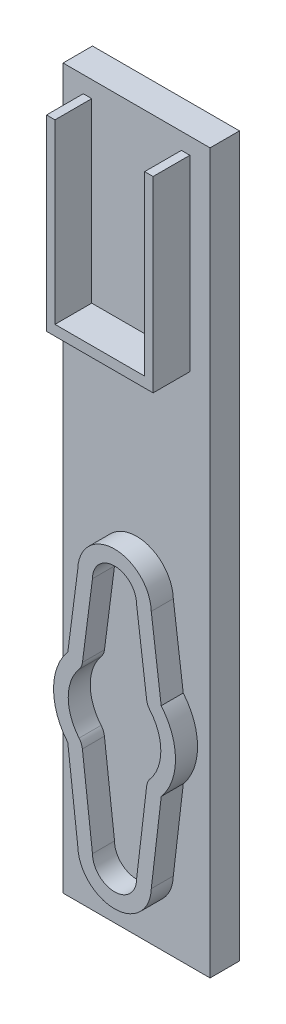
ISO-10303-21;
HEADER;
FILE_DESCRIPTION(('STEP AP214'),'2;1');
FILE_NAME('part.step','',(''),(''),'','','');
FILE_SCHEMA(('AUTOMOTIVE_DESIGN { 1 0 10303 214 1 1 1 1 }'));
ENDSEC;
DATA;
#1=APPLICATION_CONTEXT('core data for automotive mechanical design processes');
#2=APPLICATION_PROTOCOL_DEFINITION('international standard','automotive_design',2000,#1);
#3=PRODUCT_CONTEXT('',#1,'mechanical');
#4=PRODUCT('Part','Part','',(#3));
#5=PRODUCT_RELATED_PRODUCT_CATEGORY('part','',(#4));
#6=PRODUCT_DEFINITION_FORMATION('','',#4);
#7=PRODUCT_DEFINITION_CONTEXT('part definition',#1,'design');
#8=PRODUCT_DEFINITION('design','',#6,#7);
#9=PRODUCT_DEFINITION_SHAPE('','',#8);
#10=(LENGTH_UNIT() NAMED_UNIT(*) SI_UNIT(.MILLI.,.METRE.));
#11=(NAMED_UNIT(*) PLANE_ANGLE_UNIT() SI_UNIT($,.RADIAN.));
#12=(NAMED_UNIT(*) SI_UNIT($,.STERADIAN.) SOLID_ANGLE_UNIT());
#13=UNCERTAINTY_MEASURE_WITH_UNIT(LENGTH_MEASURE(1.E-05),#10,'distance_accuracy_value','');
#14=(GEOMETRIC_REPRESENTATION_CONTEXT(3) GLOBAL_UNCERTAINTY_ASSIGNED_CONTEXT((#13)) GLOBAL_UNIT_ASSIGNED_CONTEXT((#10,
#11,#12)) REPRESENTATION_CONTEXT('',''));
#15=CARTESIAN_POINT('',(0.,0.,0.));
#16=DIRECTION('',(0.,0.,1.));
#17=DIRECTION('',(1.,0.,0.));
#18=AXIS2_PLACEMENT_3D('',#15,#16,#17);
#19=CARTESIAN_POINT('',(0.,0.,3.));
#20=DIRECTION('',(0.,0.,1.));
#21=DIRECTION('',(1.,0.,0.));
#22=AXIS2_PLACEMENT_3D('',#19,#20,#21);
#23=PLANE('',#22);
#24=CARTESIAN_POINT('',(0.,0.,3.));
#25=DIRECTION('',(0.,0.,1.));
#26=DIRECTION('',(1.,0.,0.));
#27=AXIS2_PLACEMENT_3D('',#24,#25,#26);
#28=CIRCLE('',#27,8.3);
#29=CARTESIAN_POINT('',(-6.34973544168167,5.34517163622009,3.));
#30=VERTEX_POINT('',#29);
#31=CARTESIAN_POINT('',(-6.35843222810027,-5.33482329610418,3.));
#32=VERTEX_POINT('',#31);
#33=EDGE_CURVE('E426',#30,#32,#28,.T.);
#34=ORIENTED_EDGE('',*,*,#33,.T.);
#35=DIRECTION('',(0.116913648980178,-0.993142083834,0.));
#36=VECTOR('',#35,1.);
#37=CARTESIAN_POINT('',(-4.99825322112193,-16.8890859947798,3.));
#38=LINE('',#37,#36);
#39=CARTESIAN_POINT('',(-4.99825322112193,-16.8890859947798,3.));
#40=VERTEX_POINT('',#39);
#41=EDGE_CURVE('E429',#32,#40,#38,.T.);
#42=ORIENTED_EDGE('',*,*,#41,.T.);
#43=CARTESIAN_POINT('',(0.,-16.756931775989,3.));
#44=DIRECTION('',(0.,0.,1.));
#45=DIRECTION('',(1.,0.,0.));
#46=AXIS2_PLACEMENT_3D('',#43,#44,#45);
#47=CIRCLE('',#46,5.);
#48=CARTESIAN_POINT('',(4.99825322112194,-16.8890859947798,3.));
#49=VERTEX_POINT('',#48);
#50=EDGE_CURVE('E432',#40,#49,#47,.T.);
#51=ORIENTED_EDGE('',*,*,#50,.T.);
#52=DIRECTION('',(0.116913648980178,0.993142083834,0.));
#53=VECTOR('',#52,1.);
#54=CARTESIAN_POINT('',(6.35843222810027,-5.33482329610418,3.));
#55=LINE('',#54,#53);
#56=CARTESIAN_POINT('',(6.35843222810027,-5.33482329610418,3.));
#57=VERTEX_POINT('',#56);
#58=EDGE_CURVE('E434',#49,#57,#55,.T.);
#59=ORIENTED_EDGE('',*,*,#58,.T.);
#60=CARTESIAN_POINT('',(0.,0.,3.));
#61=DIRECTION('',(0.,0.,1.));
#62=DIRECTION('',(1.,0.,0.));
#63=AXIS2_PLACEMENT_3D('',#60,#61,#62);
#64=CIRCLE('',#63,8.3);
#65=CARTESIAN_POINT('',(6.34973544168167,5.34517163622009,3.));
#66=VERTEX_POINT('',#65);
#67=EDGE_CURVE('E436',#57,#66,#64,.T.);
#68=ORIENTED_EDGE('',*,*,#67,.T.);
#69=DIRECTION('',(-0.128377445450588,0.991725381090744,0.));
#70=VECTOR('',#69,1.);
#71=CARTESIAN_POINT('',(4.99789121270524,15.7882695530811,3.));
#72=LINE('',#71,#70);
#73=CARTESIAN_POINT('',(4.99789121270524,15.7882695530811,3.));
#74=VERTEX_POINT('',#73);
#75=EDGE_CURVE('E438',#66,#74,#72,.T.);
#76=ORIENTED_EDGE('',*,*,#75,.T.);
#77=CARTESIAN_POINT('',(0.,15.643068224011,3.));
#78=DIRECTION('',(0.,0.,1.));
#79=DIRECTION('',(1.,0.,0.));
#80=AXIS2_PLACEMENT_3D('',#77,#78,#79);
#81=CIRCLE('',#80,5.);
#82=CARTESIAN_POINT('',(-4.99789121270524,15.7882695530811,3.));
#83=VERTEX_POINT('',#82);
#84=EDGE_CURVE('E440',#74,#83,#81,.T.);
#85=ORIENTED_EDGE('',*,*,#84,.T.);
#86=DIRECTION('',(-0.128377445450588,-0.991725381090744,0.));
#87=VECTOR('',#86,1.);
#88=CARTESIAN_POINT('',(-6.34973544168167,5.34517163622009,3.));
#89=LINE('',#88,#87);
#90=EDGE_CURVE('E442',#83,#30,#89,.T.);
#91=ORIENTED_EDGE('',*,*,#90,.T.);
#92=EDGE_LOOP('',(#34,#42,#51,#59,#68,#76,#85,#91));
#93=FACE_BOUND('',#92,.T.);
#94=DIRECTION('',(0.116913648980178,-0.993142083834,0.));
#95=VECTOR('',#94,1.);
#96=CARTESIAN_POINT('',(-3.,-16.756931775989,3.));
#97=LINE('',#96,#95);
#98=CARTESIAN_POINT('',(-4.37214806043227,-5.10099599814382,3.));
#99=VERTEX_POINT('',#98);
#100=CARTESIAN_POINT('',(-3.,-16.756931775989,3.));
#101=VERTEX_POINT('',#100);
#102=EDGE_CURVE('E344',#99,#101,#97,.T.);
#103=ORIENTED_EDGE('',*,*,#102,.F.);
#104=CARTESIAN_POINT('',(-6.35843222810027,-5.33482329610418,3.));
#105=DIRECTION('',(0.,0.,-1.));
#106=DIRECTION('',(1.,0.,0.));
#107=AXIS2_PLACEMENT_3D('',#104,#105,#106);
#108=CIRCLE('',#107,2.);
#109=CARTESIAN_POINT('',(-4.82627988397972,-4.04932370668149,3.));
#110=VERTEX_POINT('',#109);
#111=EDGE_CURVE('E342',#110,#99,#108,.T.);
#112=ORIENTED_EDGE('',*,*,#111,.F.);
#113=CARTESIAN_POINT('',(0.,0.,3.));
#114=DIRECTION('',(0.,0.,1.));
#115=DIRECTION('',(1.,0.,0.));
#116=AXIS2_PLACEMENT_3D('',#113,#114,#115);
#117=CIRCLE('',#116,6.3);
#118=CARTESIAN_POINT('',(-4.81967870874633,4.05717847086585,3.));
#119=VERTEX_POINT('',#118);
#120=EDGE_CURVE('E365',#119,#110,#117,.T.);
#121=ORIENTED_EDGE('',*,*,#120,.F.);
#122=CARTESIAN_POINT('',(-6.34973544168167,5.34517163622009,3.));
#123=DIRECTION('',(0.,0.,-1.));
#124=DIRECTION('',(-1.,0.,0.));
#125=AXIS2_PLACEMENT_3D('',#122,#123,#124);
#126=CIRCLE('',#125,2.);
#127=CARTESIAN_POINT('',(-4.36628467950018,5.08841674531891,3.));
#128=VERTEX_POINT('',#127);
#129=EDGE_CURVE('E363',#128,#119,#126,.T.);
#130=ORIENTED_EDGE('',*,*,#129,.F.);
#131=DIRECTION('',(-0.128377445450588,-0.991725381090744,0.));
#132=VECTOR('',#131,1.);
#133=CARTESIAN_POINT('',(-4.36628467950018,5.08841674531891,3.));
#134=LINE('',#133,#132);
#135=CARTESIAN_POINT('',(-3.,15.643068224011,3.));
#136=VERTEX_POINT('',#135);
#137=EDGE_CURVE('E361',#136,#128,#134,.T.);
#138=ORIENTED_EDGE('',*,*,#137,.F.);
#139=CARTESIAN_POINT('',(0.,15.643068224011,3.));
#140=DIRECTION('',(0.,0.,1.));
#141=DIRECTION('',(1.,0.,0.));
#142=AXIS2_PLACEMENT_3D('',#139,#140,#141);
#143=CIRCLE('',#142,3.);
#144=CARTESIAN_POINT('',(3.,15.643068224011,3.));
#145=VERTEX_POINT('',#144);
#146=EDGE_CURVE('E359',#145,#136,#143,.T.);
#147=ORIENTED_EDGE('',*,*,#146,.F.);
#148=DIRECTION('',(-0.128377445450588,0.991725381090744,0.));
#149=VECTOR('',#148,1.);
#150=CARTESIAN_POINT('',(3.,15.643068224011,3.));
#151=LINE('',#150,#149);
#152=CARTESIAN_POINT('',(4.36628467950018,5.08841674531891,3.));
#153=VERTEX_POINT('',#152);
#154=EDGE_CURVE('E357',#153,#145,#151,.T.);
#155=ORIENTED_EDGE('',*,*,#154,.F.);
#156=CARTESIAN_POINT('',(6.34973544168167,5.34517163622009,3.));
#157=DIRECTION('',(0.,0.,-1.));
#158=DIRECTION('',(-1.,0.,0.));
#159=AXIS2_PLACEMENT_3D('',#156,#157,#158);
#160=CIRCLE('',#159,2.);
#161=CARTESIAN_POINT('',(4.81967870874632,4.05717847086585,3.));
#162=VERTEX_POINT('',#161);
#163=EDGE_CURVE('E355',#162,#153,#160,.T.);
#164=ORIENTED_EDGE('',*,*,#163,.F.);
#165=CARTESIAN_POINT('',(0.,0.,3.));
#166=DIRECTION('',(0.,0.,1.));
#167=DIRECTION('',(1.,0.,0.));
#168=AXIS2_PLACEMENT_3D('',#165,#166,#167);
#169=CIRCLE('',#168,6.3);
#170=CARTESIAN_POINT('',(4.82627988397972,-4.04932370668149,3.));
#171=VERTEX_POINT('',#170);
#172=EDGE_CURVE('E353',#171,#162,#169,.T.);
#173=ORIENTED_EDGE('',*,*,#172,.F.);
#174=CARTESIAN_POINT('',(6.35843222810027,-5.33482329610418,3.));
#175=DIRECTION('',(0.,0.,-1.));
#176=DIRECTION('',(1.,0.,0.));
#177=AXIS2_PLACEMENT_3D('',#174,#175,#176);
#178=CIRCLE('',#177,2.);
#179=CARTESIAN_POINT('',(4.37214806043227,-5.10099599814383,3.));
#180=VERTEX_POINT('',#179);
#181=EDGE_CURVE('E351',#180,#171,#178,.T.);
#182=ORIENTED_EDGE('',*,*,#181,.F.);
#183=DIRECTION('',(0.116913648980178,0.993142083834,0.));
#184=VECTOR('',#183,1.);
#185=CARTESIAN_POINT('',(4.37214806043227,-5.10099599814383,3.));
#186=LINE('',#185,#184);
#187=CARTESIAN_POINT('',(3.,-16.756931775989,3.));
#188=VERTEX_POINT('',#187);
#189=EDGE_CURVE('E349',#188,#180,#186,.T.);
#190=ORIENTED_EDGE('',*,*,#189,.F.);
#191=CARTESIAN_POINT('',(0.,-16.756931775989,3.));
#192=DIRECTION('',(0.,0.,1.));
#193=DIRECTION('',(1.,0.,0.));
#194=AXIS2_PLACEMENT_3D('',#191,#192,#193);
#195=CIRCLE('',#194,3.);
#196=EDGE_CURVE('E347',#101,#188,#195,.T.);
#197=ORIENTED_EDGE('',*,*,#196,.F.);
#198=EDGE_LOOP('',(#103,#112,#121,#130,#138,#147,#155,#164,#173,#182,#190,#197));
#199=FACE_BOUND('',#198,.T.);
#200=ADVANCED_FACE('F34',(#93,#199),#23,.T.);
#201=CARTESIAN_POINT('',(0.,0.,3.));
#202=DIRECTION('',(0.,0.,-1.));
#203=DIRECTION('',(-1.,0.,0.));
#204=AXIS2_PLACEMENT_3D('',#201,#202,#203);
#205=CYLINDRICAL_SURFACE('',#204,8.3);
#206=CARTESIAN_POINT('',(0.,0.,0.));
#207=DIRECTION('',(0.,0.,1.));
#208=DIRECTION('',(1.,0.,0.));
#209=AXIS2_PLACEMENT_3D('',#206,#207,#208);
#210=CIRCLE('',#209,8.3);
#211=CARTESIAN_POINT('',(-6.34973544168167,5.34517163622009,0.));
#212=VERTEX_POINT('',#211);
#213=CARTESIAN_POINT('',(-6.35843222810027,-5.33482329610418,0.));
#214=VERTEX_POINT('',#213);
#215=EDGE_CURVE('E425',#212,#214,#210,.T.);
#216=ORIENTED_EDGE('',*,*,#215,.T.);
#217=DIRECTION('',(0.,0.,-1.));
#218=VECTOR('',#217,1.);
#219=CARTESIAN_POINT('',(-6.35843222810027,-5.33482329610418,3.));
#220=LINE('',#219,#218);
#221=EDGE_CURVE('E11',#32,#214,#220,.T.);
#222=ORIENTED_EDGE('',*,*,#221,.F.);
#223=ORIENTED_EDGE('',*,*,#33,.F.);
#224=DIRECTION('',(0.,0.,-1.));
#225=VECTOR('',#224,1.);
#226=CARTESIAN_POINT('',(-6.34973544168167,5.34517163622009,3.));
#227=LINE('',#226,#225);
#228=EDGE_CURVE('E444',#30,#212,#227,.T.);
#229=ORIENTED_EDGE('',*,*,#228,.T.);
#230=EDGE_LOOP('',(#216,#222,#223,#229));
#231=FACE_BOUND('',#230,.T.);
#232=ADVANCED_FACE('F36',(#231),#205,.T.);
#233=CARTESIAN_POINT('',(-4.99825322112193,-16.8890859947798,3.));
#234=DIRECTION('',(0.993142083834,0.116913648980178,0.));
#235=DIRECTION('',(-0.116913648980178,0.993142083834,0.));
#236=AXIS2_PLACEMENT_3D('',#233,#234,#235);
#237=PLANE('',#236);
#238=DIRECTION('',(0.116913648980178,-0.993142083834,0.));
#239=VECTOR('',#238,1.);
#240=CARTESIAN_POINT('',(-4.99825322112193,-16.8890859947798,0.));
#241=LINE('',#240,#239);
#242=CARTESIAN_POINT('',(-4.99825322112193,-16.8890859947798,0.));
#243=VERTEX_POINT('',#242);
#244=EDGE_CURVE('E447',#214,#243,#241,.T.);
#245=ORIENTED_EDGE('',*,*,#244,.T.);
#246=DIRECTION('',(0.,0.,-1.));
#247=VECTOR('',#246,1.);
#248=CARTESIAN_POINT('',(-4.99825322112193,-16.8890859947798,3.));
#249=LINE('',#248,#247);
#250=EDGE_CURVE('E42',#40,#243,#249,.T.);
#251=ORIENTED_EDGE('',*,*,#250,.F.);
#252=ORIENTED_EDGE('',*,*,#41,.F.);
#253=ORIENTED_EDGE('',*,*,#221,.T.);
#254=EDGE_LOOP('',(#245,#251,#252,#253));
#255=FACE_BOUND('',#254,.T.);
#256=ADVANCED_FACE('F490',(#255),#237,.F.);
#257=CARTESIAN_POINT('',(0.,-16.756931775989,3.));
#258=DIRECTION('',(0.,0.,-1.));
#259=DIRECTION('',(-1.,0.,0.));
#260=AXIS2_PLACEMENT_3D('',#257,#258,#259);
#261=CYLINDRICAL_SURFACE('',#260,5.);
#262=CARTESIAN_POINT('',(0.,-16.756931775989,0.));
#263=DIRECTION('',(0.,0.,1.));
#264=DIRECTION('',(1.,0.,0.));
#265=AXIS2_PLACEMENT_3D('',#262,#263,#264);
#266=CIRCLE('',#265,5.);
#267=CARTESIAN_POINT('',(4.99825322112194,-16.8890859947798,0.));
#268=VERTEX_POINT('',#267);
#269=EDGE_CURVE('E450',#243,#268,#266,.T.);
#270=ORIENTED_EDGE('',*,*,#269,.T.);
#271=DIRECTION('',(0.,0.,-1.));
#272=VECTOR('',#271,1.);
#273=CARTESIAN_POINT('',(4.99825322112194,-16.8890859947798,3.));
#274=LINE('',#273,#272);
#275=EDGE_CURVE('E481',#49,#268,#274,.T.);
#276=ORIENTED_EDGE('',*,*,#275,.F.);
#277=ORIENTED_EDGE('',*,*,#50,.F.);
#278=ORIENTED_EDGE('',*,*,#250,.T.);
#279=EDGE_LOOP('',(#270,#276,#277,#278));
#280=FACE_BOUND('',#279,.T.);
#281=ADVANCED_FACE('F487',(#280),#261,.T.);
#282=CARTESIAN_POINT('',(6.35843222810027,-5.33482329610418,3.));
#283=DIRECTION('',(-0.993142083834,0.116913648980177,0.));
#284=DIRECTION('',(-0.116913648980178,-0.993142083834,0.));
#285=AXIS2_PLACEMENT_3D('',#282,#283,#284);
#286=PLANE('',#285);
#287=DIRECTION('',(0.116913648980178,0.993142083834,0.));
#288=VECTOR('',#287,1.);
#289=CARTESIAN_POINT('',(6.35843222810027,-5.33482329610418,0.));
#290=LINE('',#289,#288);
#291=CARTESIAN_POINT('',(6.35843222810027,-5.33482329610418,0.));
#292=VERTEX_POINT('',#291);
#293=EDGE_CURVE('E453',#268,#292,#290,.T.);
#294=ORIENTED_EDGE('',*,*,#293,.T.);
#295=DIRECTION('',(0.,0.,-1.));
#296=VECTOR('',#295,1.);
#297=CARTESIAN_POINT('',(6.35843222810027,-5.33482329610418,3.));
#298=LINE('',#297,#296);
#299=EDGE_CURVE('E478',#57,#292,#298,.T.);
#300=ORIENTED_EDGE('',*,*,#299,.F.);
#301=ORIENTED_EDGE('',*,*,#58,.F.);
#302=ORIENTED_EDGE('',*,*,#275,.T.);
#303=EDGE_LOOP('',(#294,#300,#301,#302));
#304=FACE_BOUND('',#303,.T.);
#305=ADVANCED_FACE('F497',(#304),#286,.F.);
#306=CARTESIAN_POINT('',(0.,0.,3.));
#307=DIRECTION('',(0.,0.,-1.));
#308=DIRECTION('',(-1.,0.,0.));
#309=AXIS2_PLACEMENT_3D('',#306,#307,#308);
#310=CYLINDRICAL_SURFACE('',#309,8.3);
#311=CARTESIAN_POINT('',(0.,0.,0.));
#312=DIRECTION('',(0.,0.,1.));
#313=DIRECTION('',(1.,0.,0.));
#314=AXIS2_PLACEMENT_3D('',#311,#312,#313);
#315=CIRCLE('',#314,8.3);
#316=CARTESIAN_POINT('',(6.34973544168167,5.34517163622009,0.));
#317=VERTEX_POINT('',#316);
#318=EDGE_CURVE('E456',#292,#317,#315,.T.);
#319=ORIENTED_EDGE('',*,*,#318,.T.);
#320=DIRECTION('',(0.,0.,-1.));
#321=VECTOR('',#320,1.);
#322=CARTESIAN_POINT('',(6.34973544168167,5.34517163622009,3.));
#323=LINE('',#322,#321);
#324=EDGE_CURVE('E475',#66,#317,#323,.T.);
#325=ORIENTED_EDGE('',*,*,#324,.F.);
#326=ORIENTED_EDGE('',*,*,#67,.F.);
#327=ORIENTED_EDGE('',*,*,#299,.T.);
#328=EDGE_LOOP('',(#319,#325,#326,#327));
#329=FACE_BOUND('',#328,.T.);
#330=ADVANCED_FACE('F501',(#329),#310,.T.);
#331=CARTESIAN_POINT('',(4.99789121270524,15.7882695530811,3.));
#332=DIRECTION('',(-0.991725381090744,-0.128377445450588,0.));
#333=DIRECTION('',(0.128377445450588,-0.991725381090744,0.));
#334=AXIS2_PLACEMENT_3D('',#331,#332,#333);
#335=PLANE('',#334);
#336=DIRECTION('',(-0.128377445450588,0.991725381090744,0.));
#337=VECTOR('',#336,1.);
#338=CARTESIAN_POINT('',(4.99789121270524,15.7882695530811,0.));
#339=LINE('',#338,#337);
#340=CARTESIAN_POINT('',(4.99789121270524,15.7882695530811,0.));
#341=VERTEX_POINT('',#340);
#342=EDGE_CURVE('E459',#317,#341,#339,.T.);
#343=ORIENTED_EDGE('',*,*,#342,.T.);
#344=DIRECTION('',(0.,0.,-1.));
#345=VECTOR('',#344,1.);
#346=CARTESIAN_POINT('',(4.99789121270524,15.7882695530811,3.));
#347=LINE('',#346,#345);
#348=EDGE_CURVE('E472',#74,#341,#347,.T.);
#349=ORIENTED_EDGE('',*,*,#348,.F.);
#350=ORIENTED_EDGE('',*,*,#75,.F.);
#351=ORIENTED_EDGE('',*,*,#324,.T.);
#352=EDGE_LOOP('',(#343,#349,#350,#351));
#353=FACE_BOUND('',#352,.T.);
#354=ADVANCED_FACE('F518',(#353),#335,.F.);
#355=CARTESIAN_POINT('',(0.,15.643068224011,3.));
#356=DIRECTION('',(0.,0.,-1.));
#357=DIRECTION('',(-1.,0.,0.));
#358=AXIS2_PLACEMENT_3D('',#355,#356,#357);
#359=CYLINDRICAL_SURFACE('',#358,5.);
#360=CARTESIAN_POINT('',(0.,15.643068224011,0.));
#361=DIRECTION('',(0.,0.,1.));
#362=DIRECTION('',(1.,0.,0.));
#363=AXIS2_PLACEMENT_3D('',#360,#361,#362);
#364=CIRCLE('',#363,5.);
#365=CARTESIAN_POINT('',(-4.99789121270524,15.7882695530811,0.));
#366=VERTEX_POINT('',#365);
#367=EDGE_CURVE('E462',#341,#366,#364,.T.);
#368=ORIENTED_EDGE('',*,*,#367,.T.);
#369=DIRECTION('',(0.,0.,-1.));
#370=VECTOR('',#369,1.);
#371=CARTESIAN_POINT('',(-4.99789121270524,15.7882695530811,3.));
#372=LINE('',#371,#370);
#373=EDGE_CURVE('E469',#83,#366,#372,.T.);
#374=ORIENTED_EDGE('',*,*,#373,.F.);
#375=ORIENTED_EDGE('',*,*,#84,.F.);
#376=ORIENTED_EDGE('',*,*,#348,.T.);
#377=EDGE_LOOP('',(#368,#374,#375,#376));
#378=FACE_BOUND('',#377,.T.);
#379=ADVANCED_FACE('F515',(#378),#359,.T.);
#380=CARTESIAN_POINT('',(-6.34973544168167,5.34517163622009,3.));
#381=DIRECTION('',(0.991725381090744,-0.128377445450588,0.));
#382=DIRECTION('',(0.128377445450588,0.991725381090744,0.));
#383=AXIS2_PLACEMENT_3D('',#380,#381,#382);
#384=PLANE('',#383);
#385=DIRECTION('',(-0.128377445450588,-0.991725381090744,0.));
#386=VECTOR('',#385,1.);
#387=CARTESIAN_POINT('',(-6.34973544168167,5.34517163622009,0.));
#388=LINE('',#387,#386);
#389=EDGE_CURVE('E430',#366,#212,#388,.T.);
#390=ORIENTED_EDGE('',*,*,#389,.T.);
#391=ORIENTED_EDGE('',*,*,#228,.F.);
#392=ORIENTED_EDGE('',*,*,#90,.F.);
#393=ORIENTED_EDGE('',*,*,#373,.T.);
#394=EDGE_LOOP('',(#390,#391,#392,#393));
#395=FACE_BOUND('',#394,.T.);
#396=ADVANCED_FACE('F512',(#395),#384,.F.);
#397=CARTESIAN_POINT('',(-6.35843222810027,-5.33482329610418,3.));
#398=DIRECTION('',(0.,0.,-1.));
#399=DIRECTION('',(-1.,0.,0.));
#400=AXIS2_PLACEMENT_3D('',#397,#398,#399);
#401=CYLINDRICAL_SURFACE('',#400,2.);
#402=CARTESIAN_POINT('',(-6.35843222810027,-5.33482329610418,0.));
#403=DIRECTION('',(0.,0.,-1.));
#404=DIRECTION('',(1.,0.,0.));
#405=AXIS2_PLACEMENT_3D('',#402,#403,#404);
#406=CIRCLE('',#405,2.);
#407=CARTESIAN_POINT('',(-4.82627988397972,-4.04932370668149,0.));
#408=VERTEX_POINT('',#407);
#409=CARTESIAN_POINT('',(-4.37214806043227,-5.10099599814382,0.));
#410=VERTEX_POINT('',#409);
#411=EDGE_CURVE('E335',#408,#410,#406,.T.);
#412=ORIENTED_EDGE('',*,*,#411,.F.);
#413=DIRECTION('',(0.,0.,-1.));
#414=VECTOR('',#413,1.);
#415=CARTESIAN_POINT('',(-4.82627988397972,-4.04932370668149,3.));
#416=LINE('',#415,#414);
#417=EDGE_CURVE('E367',#110,#408,#416,.T.);
#418=ORIENTED_EDGE('',*,*,#417,.F.);
#419=ORIENTED_EDGE('',*,*,#111,.T.);
#420=DIRECTION('',(0.,0.,-1.));
#421=VECTOR('',#420,1.);
#422=CARTESIAN_POINT('',(-4.37214806043227,-5.10099599814382,3.));
#423=LINE('',#422,#421);
#424=EDGE_CURVE('E422',#99,#410,#423,.T.);
#425=ORIENTED_EDGE('',*,*,#424,.T.);
#426=EDGE_LOOP('',(#412,#418,#419,#425));
#427=FACE_BOUND('',#426,.T.);
#428=ADVANCED_FACE('F534',(#427),#401,.T.);
#429=CARTESIAN_POINT('',(-3.,-16.756931775989,3.));
#430=DIRECTION('',(0.993142083834,0.116913648980178,0.));
#431=DIRECTION('',(-0.116913648980178,0.993142083834,0.));
#432=AXIS2_PLACEMENT_3D('',#429,#430,#431);
#433=PLANE('',#432);
#434=DIRECTION('',(0.116913648980178,-0.993142083834,0.));
#435=VECTOR('',#434,1.);
#436=CARTESIAN_POINT('',(-3.,-16.756931775989,0.));
#437=LINE('',#436,#435);
#438=CARTESIAN_POINT('',(-3.,-16.756931775989,0.));
#439=VERTEX_POINT('',#438);
#440=EDGE_CURVE('E370',#410,#439,#437,.T.);
#441=ORIENTED_EDGE('',*,*,#440,.F.);
#442=ORIENTED_EDGE('',*,*,#424,.F.);
#443=ORIENTED_EDGE('',*,*,#102,.T.);
#444=DIRECTION('',(0.,0.,-1.));
#445=VECTOR('',#444,1.);
#446=CARTESIAN_POINT('',(-3.,-16.756931775989,3.));
#447=LINE('',#446,#445);
#448=EDGE_CURVE('E420',#101,#439,#447,.T.);
#449=ORIENTED_EDGE('',*,*,#448,.T.);
#450=EDGE_LOOP('',(#441,#442,#443,#449));
#451=FACE_BOUND('',#450,.T.);
#452=ADVANCED_FACE('F540',(#451),#433,.T.);
#453=CARTESIAN_POINT('',(0.,-16.756931775989,3.));
#454=DIRECTION('',(0.,0.,-1.));
#455=DIRECTION('',(-1.,0.,0.));
#456=AXIS2_PLACEMENT_3D('',#453,#454,#455);
#457=CYLINDRICAL_SURFACE('',#456,3.);
#458=CARTESIAN_POINT('',(0.,-16.756931775989,0.));
#459=DIRECTION('',(0.,0.,1.));
#460=DIRECTION('',(1.,0.,0.));
#461=AXIS2_PLACEMENT_3D('',#458,#459,#460);
#462=CIRCLE('',#461,3.);
#463=CARTESIAN_POINT('',(3.,-16.756931775989,0.));
#464=VERTEX_POINT('',#463);
#465=EDGE_CURVE('E373',#439,#464,#462,.T.);
#466=ORIENTED_EDGE('',*,*,#465,.F.);
#467=ORIENTED_EDGE('',*,*,#448,.F.);
#468=ORIENTED_EDGE('',*,*,#196,.T.);
#469=DIRECTION('',(0.,0.,-1.));
#470=VECTOR('',#469,1.);
#471=CARTESIAN_POINT('',(3.,-16.756931775989,3.));
#472=LINE('',#471,#470);
#473=EDGE_CURVE('E418',#188,#464,#472,.T.);
#474=ORIENTED_EDGE('',*,*,#473,.T.);
#475=EDGE_LOOP('',(#466,#467,#468,#474));
#476=FACE_BOUND('',#475,.T.);
#477=ADVANCED_FACE('F545',(#476),#457,.F.);
#478=CARTESIAN_POINT('',(4.37214806043227,-5.10099599814383,3.));
#479=DIRECTION('',(-0.993142083834,0.116913648980178,0.));
#480=DIRECTION('',(-0.116913648980178,-0.993142083834,0.));
#481=AXIS2_PLACEMENT_3D('',#478,#479,#480);
#482=PLANE('',#481);
#483=DIRECTION('',(0.116913648980178,0.993142083834,0.));
#484=VECTOR('',#483,1.);
#485=CARTESIAN_POINT('',(4.37214806043227,-5.10099599814383,0.));
#486=LINE('',#485,#484);
#487=CARTESIAN_POINT('',(4.37214806043227,-5.10099599814383,0.));
#488=VERTEX_POINT('',#487);
#489=EDGE_CURVE('E376',#464,#488,#486,.T.);
#490=ORIENTED_EDGE('',*,*,#489,.F.);
#491=ORIENTED_EDGE('',*,*,#473,.F.);
#492=ORIENTED_EDGE('',*,*,#189,.T.);
#493=DIRECTION('',(0.,0.,-1.));
#494=VECTOR('',#493,1.);
#495=CARTESIAN_POINT('',(4.37214806043227,-5.10099599814383,3.));
#496=LINE('',#495,#494);
#497=EDGE_CURVE('E416',#180,#488,#496,.T.);
#498=ORIENTED_EDGE('',*,*,#497,.T.);
#499=EDGE_LOOP('',(#490,#491,#492,#498));
#500=FACE_BOUND('',#499,.T.);
#501=ADVANCED_FACE('F567',(#500),#482,.T.);
#502=CARTESIAN_POINT('',(6.35843222810027,-5.33482329610418,3.));
#503=DIRECTION('',(0.,0.,-1.));
#504=DIRECTION('',(-1.,0.,0.));
#505=AXIS2_PLACEMENT_3D('',#502,#503,#504);
#506=CYLINDRICAL_SURFACE('',#505,2.);
#507=CARTESIAN_POINT('',(6.35843222810027,-5.33482329610418,0.));
#508=DIRECTION('',(0.,0.,-1.));
#509=DIRECTION('',(1.,0.,0.));
#510=AXIS2_PLACEMENT_3D('',#507,#508,#509);
#511=CIRCLE('',#510,2.);
#512=CARTESIAN_POINT('',(4.82627988397972,-4.04932370668149,0.));
#513=VERTEX_POINT('',#512);
#514=EDGE_CURVE('E379',#488,#513,#511,.T.);
#515=ORIENTED_EDGE('',*,*,#514,.F.);
#516=ORIENTED_EDGE('',*,*,#497,.F.);
#517=ORIENTED_EDGE('',*,*,#181,.T.);
#518=DIRECTION('',(0.,0.,-1.));
#519=VECTOR('',#518,1.);
#520=CARTESIAN_POINT('',(4.82627988397972,-4.04932370668149,3.));
#521=LINE('',#520,#519);
#522=EDGE_CURVE('E414',#171,#513,#521,.T.);
#523=ORIENTED_EDGE('',*,*,#522,.T.);
#524=EDGE_LOOP('',(#515,#516,#517,#523));
#525=FACE_BOUND('',#524,.T.);
#526=ADVANCED_FACE('F572',(#525),#506,.T.);
#527=CARTESIAN_POINT('',(0.,0.,3.));
#528=DIRECTION('',(0.,0.,-1.));
#529=DIRECTION('',(-1.,0.,0.));
#530=AXIS2_PLACEMENT_3D('',#527,#528,#529);
#531=CYLINDRICAL_SURFACE('',#530,6.3);
#532=CARTESIAN_POINT('',(0.,0.,0.));
#533=DIRECTION('',(0.,0.,1.));
#534=DIRECTION('',(1.,0.,0.));
#535=AXIS2_PLACEMENT_3D('',#532,#533,#534);
#536=CIRCLE('',#535,6.3);
#537=CARTESIAN_POINT('',(4.81967870874632,4.05717847086585,0.));
#538=VERTEX_POINT('',#537);
#539=EDGE_CURVE('E382',#513,#538,#536,.T.);
#540=ORIENTED_EDGE('',*,*,#539,.F.);
#541=ORIENTED_EDGE('',*,*,#522,.F.);
#542=ORIENTED_EDGE('',*,*,#172,.T.);
#543=DIRECTION('',(0.,0.,-1.));
#544=VECTOR('',#543,1.);
#545=CARTESIAN_POINT('',(4.81967870874632,4.05717847086585,3.));
#546=LINE('',#545,#544);
#547=EDGE_CURVE('E412',#162,#538,#546,.T.);
#548=ORIENTED_EDGE('',*,*,#547,.T.);
#549=EDGE_LOOP('',(#540,#541,#542,#548));
#550=FACE_BOUND('',#549,.T.);
#551=ADVANCED_FACE('F577',(#550),#531,.F.);
#552=CARTESIAN_POINT('',(6.34973544168167,5.34517163622009,3.));
#553=DIRECTION('',(0.,0.,-1.));
#554=DIRECTION('',(-1.,0.,0.));
#555=AXIS2_PLACEMENT_3D('',#552,#553,#554);
#556=CYLINDRICAL_SURFACE('',#555,2.);
#557=CARTESIAN_POINT('',(6.34973544168167,5.34517163622009,0.));
#558=DIRECTION('',(0.,0.,-1.));
#559=DIRECTION('',(-1.,0.,0.));
#560=AXIS2_PLACEMENT_3D('',#557,#558,#559);
#561=CIRCLE('',#560,2.);
#562=CARTESIAN_POINT('',(4.36628467950018,5.08841674531891,0.));
#563=VERTEX_POINT('',#562);
#564=EDGE_CURVE('E385',#538,#563,#561,.T.);
#565=ORIENTED_EDGE('',*,*,#564,.F.);
#566=ORIENTED_EDGE('',*,*,#547,.F.);
#567=ORIENTED_EDGE('',*,*,#163,.T.);
#568=DIRECTION('',(0.,0.,-1.));
#569=VECTOR('',#568,1.);
#570=CARTESIAN_POINT('',(4.36628467950018,5.08841674531891,3.));
#571=LINE('',#570,#569);
#572=EDGE_CURVE('E410',#153,#563,#571,.T.);
#573=ORIENTED_EDGE('',*,*,#572,.T.);
#574=EDGE_LOOP('',(#565,#566,#567,#573));
#575=FACE_BOUND('',#574,.T.);
#576=ADVANCED_FACE('F582',(#575),#556,.T.);
#577=CARTESIAN_POINT('',(3.,15.643068224011,3.));
#578=DIRECTION('',(-0.991725381090744,-0.128377445450588,0.));
#579=DIRECTION('',(0.128377445450588,-0.991725381090744,0.));
#580=AXIS2_PLACEMENT_3D('',#577,#578,#579);
#581=PLANE('',#580);
#582=DIRECTION('',(-0.128377445450588,0.991725381090744,0.));
#583=VECTOR('',#582,1.);
#584=CARTESIAN_POINT('',(3.,15.643068224011,0.));
#585=LINE('',#584,#583);
#586=CARTESIAN_POINT('',(3.,15.643068224011,0.));
#587=VERTEX_POINT('',#586);
#588=EDGE_CURVE('E388',#563,#587,#585,.T.);
#589=ORIENTED_EDGE('',*,*,#588,.F.);
#590=ORIENTED_EDGE('',*,*,#572,.F.);
#591=ORIENTED_EDGE('',*,*,#154,.T.);
#592=DIRECTION('',(0.,0.,-1.));
#593=VECTOR('',#592,1.);
#594=CARTESIAN_POINT('',(3.,15.643068224011,3.));
#595=LINE('',#594,#593);
#596=EDGE_CURVE('E408',#145,#587,#595,.T.);
#597=ORIENTED_EDGE('',*,*,#596,.T.);
#598=EDGE_LOOP('',(#589,#590,#591,#597));
#599=FACE_BOUND('',#598,.T.);
#600=ADVANCED_FACE('F587',(#599),#581,.T.);
#601=CARTESIAN_POINT('',(0.,15.643068224011,3.));
#602=DIRECTION('',(0.,0.,-1.));
#603=DIRECTION('',(-1.,0.,0.));
#604=AXIS2_PLACEMENT_3D('',#601,#602,#603);
#605=CYLINDRICAL_SURFACE('',#604,3.);
#606=CARTESIAN_POINT('',(0.,15.643068224011,0.));
#607=DIRECTION('',(0.,0.,1.));
#608=DIRECTION('',(1.,0.,0.));
#609=AXIS2_PLACEMENT_3D('',#606,#607,#608);
#610=CIRCLE('',#609,3.);
#611=CARTESIAN_POINT('',(-3.,15.643068224011,0.));
#612=VERTEX_POINT('',#611);
#613=EDGE_CURVE('E391',#587,#612,#610,.T.);
#614=ORIENTED_EDGE('',*,*,#613,.F.);
#615=ORIENTED_EDGE('',*,*,#596,.F.);
#616=ORIENTED_EDGE('',*,*,#146,.T.);
#617=DIRECTION('',(0.,0.,-1.));
#618=VECTOR('',#617,1.);
#619=CARTESIAN_POINT('',(-3.,15.643068224011,3.));
#620=LINE('',#619,#618);
#621=EDGE_CURVE('E406',#136,#612,#620,.T.);
#622=ORIENTED_EDGE('',*,*,#621,.T.);
#623=EDGE_LOOP('',(#614,#615,#616,#622));
#624=FACE_BOUND('',#623,.T.);
#625=ADVANCED_FACE('F592',(#624),#605,.F.);
#626=CARTESIAN_POINT('',(-4.36628467950018,5.08841674531891,3.));
#627=DIRECTION('',(0.991725381090744,-0.128377445450588,0.));
#628=DIRECTION('',(0.128377445450588,0.991725381090744,0.));
#629=AXIS2_PLACEMENT_3D('',#626,#627,#628);
#630=PLANE('',#629);
#631=DIRECTION('',(-0.128377445450588,-0.991725381090744,0.));
#632=VECTOR('',#631,1.);
#633=CARTESIAN_POINT('',(-4.36628467950018,5.08841674531891,0.));
#634=LINE('',#633,#632);
#635=CARTESIAN_POINT('',(-4.36628467950018,5.08841674531891,0.));
#636=VERTEX_POINT('',#635);
#637=EDGE_CURVE('E394',#612,#636,#634,.T.);
#638=ORIENTED_EDGE('',*,*,#637,.F.);
#639=ORIENTED_EDGE('',*,*,#621,.F.);
#640=ORIENTED_EDGE('',*,*,#137,.T.);
#641=DIRECTION('',(0.,0.,-1.));
#642=VECTOR('',#641,1.);
#643=CARTESIAN_POINT('',(-4.36628467950018,5.08841674531891,3.));
#644=LINE('',#643,#642);
#645=EDGE_CURVE('E404',#128,#636,#644,.T.);
#646=ORIENTED_EDGE('',*,*,#645,.T.);
#647=EDGE_LOOP('',(#638,#639,#640,#646));
#648=FACE_BOUND('',#647,.T.);
#649=ADVANCED_FACE('F596',(#648),#630,.T.);
#650=CARTESIAN_POINT('',(-6.34973544168167,5.34517163622009,3.));
#651=DIRECTION('',(0.,0.,-1.));
#652=DIRECTION('',(-1.,0.,0.));
#653=AXIS2_PLACEMENT_3D('',#650,#651,#652);
#654=CYLINDRICAL_SURFACE('',#653,2.);
#655=CARTESIAN_POINT('',(-6.34973544168167,5.34517163622009,0.));
#656=DIRECTION('',(0.,0.,-1.));
#657=DIRECTION('',(-1.,0.,0.));
#658=AXIS2_PLACEMENT_3D('',#655,#656,#657);
#659=CIRCLE('',#658,2.);
#660=CARTESIAN_POINT('',(-4.81967870874633,4.05717847086585,0.));
#661=VERTEX_POINT('',#660);
#662=EDGE_CURVE('E397',#636,#661,#659,.T.);
#663=ORIENTED_EDGE('',*,*,#662,.F.);
#664=ORIENTED_EDGE('',*,*,#645,.F.);
#665=ORIENTED_EDGE('',*,*,#129,.T.);
#666=DIRECTION('',(0.,0.,-1.));
#667=VECTOR('',#666,1.);
#668=CARTESIAN_POINT('',(-4.81967870874633,4.05717847086585,3.));
#669=LINE('',#668,#667);
#670=EDGE_CURVE('E57',#119,#661,#669,.T.);
#671=ORIENTED_EDGE('',*,*,#670,.T.);
#672=EDGE_LOOP('',(#663,#664,#665,#671));
#673=FACE_BOUND('',#672,.T.);
#674=ADVANCED_FACE('F599',(#673),#654,.T.);
#675=CARTESIAN_POINT('',(0.,0.,3.));
#676=DIRECTION('',(0.,0.,-1.));
#677=DIRECTION('',(-1.,0.,0.));
#678=AXIS2_PLACEMENT_3D('',#675,#676,#677);
#679=CYLINDRICAL_SURFACE('',#678,6.3);
#680=CARTESIAN_POINT('',(0.,0.,0.));
#681=DIRECTION('',(0.,0.,1.));
#682=DIRECTION('',(1.,0.,0.));
#683=AXIS2_PLACEMENT_3D('',#680,#681,#682);
#684=CIRCLE('',#683,6.3);
#685=EDGE_CURVE('E345',#661,#408,#684,.T.);
#686=ORIENTED_EDGE('',*,*,#685,.F.);
#687=ORIENTED_EDGE('',*,*,#670,.F.);
#688=ORIENTED_EDGE('',*,*,#120,.T.);
#689=ORIENTED_EDGE('',*,*,#417,.T.);
#690=EDGE_LOOP('',(#686,#687,#688,#689));
#691=FACE_BOUND('',#690,.T.);
#692=ADVANCED_FACE('F554',(#691),#679,.F.);
#693=CARTESIAN_POINT('',(0.,0.,0.));
#694=DIRECTION('',(0.,0.,1.));
#695=DIRECTION('',(1.,0.,0.));
#696=AXIS2_PLACEMENT_3D('',#693,#694,#695);
#697=PLANE('',#696);
#698=ORIENTED_EDGE('',*,*,#685,.T.);
#699=ORIENTED_EDGE('',*,*,#411,.T.);
#700=ORIENTED_EDGE('',*,*,#440,.T.);
#701=ORIENTED_EDGE('',*,*,#465,.T.);
#702=ORIENTED_EDGE('',*,*,#489,.T.);
#703=ORIENTED_EDGE('',*,*,#514,.T.);
#704=ORIENTED_EDGE('',*,*,#539,.T.);
#705=ORIENTED_EDGE('',*,*,#564,.T.);
#706=ORIENTED_EDGE('',*,*,#588,.T.);
#707=ORIENTED_EDGE('',*,*,#613,.T.);
#708=ORIENTED_EDGE('',*,*,#637,.T.);
#709=ORIENTED_EDGE('',*,*,#662,.T.);
#710=EDGE_LOOP('',(#698,#699,#700,#701,#702,#703,#704,#705,#706,#707,#708,#709));
#711=FACE_BOUND('',#710,.T.);
#712=ADVANCED_FACE('F552',(#711),#697,.T.);
#713=CARTESIAN_POINT('',(-10.,-26.4094630395313,-4.));
#714=DIRECTION('',(0.,-1.,0.));
#715=DIRECTION('',(0.,0.,-1.));
#716=AXIS2_PLACEMENT_3D('',#713,#714,#715);
#717=PLANE('',#716);
#718=DIRECTION('',(1.,0.,0.));
#719=VECTOR('',#718,1.);
#720=CARTESIAN_POINT('',(-10.,-26.4094630395313,0.));
#721=LINE('',#720,#719);
#722=CARTESIAN_POINT('',(-10.,-26.4094630395313,0.));
#723=VERTEX_POINT('',#722);
#724=CARTESIAN_POINT('',(10.,-26.4094630395313,0.));
#725=VERTEX_POINT('',#724);
#726=EDGE_CURVE('E314',#723,#725,#721,.T.);
#727=ORIENTED_EDGE('',*,*,#726,.F.);
#728=DIRECTION('',(0.,0.,1.));
#729=VECTOR('',#728,1.);
#730=CARTESIAN_POINT('',(-10.,-26.4094630395313,-4.));
#731=LINE('',#730,#729);
#732=CARTESIAN_POINT('',(-10.,-26.4094630395313,-4.));
#733=VERTEX_POINT('',#732);
#734=EDGE_CURVE('E336',#733,#723,#731,.T.);
#735=ORIENTED_EDGE('',*,*,#734,.F.);
#736=DIRECTION('',(1.,0.,0.));
#737=VECTOR('',#736,1.);
#738=CARTESIAN_POINT('',(-10.,-26.4094630395313,-4.));
#739=LINE('',#738,#737);
#740=CARTESIAN_POINT('',(10.,-26.4094630395313,-4.));
#741=VERTEX_POINT('',#740);
#742=EDGE_CURVE('E319',#733,#741,#739,.T.);
#743=ORIENTED_EDGE('',*,*,#742,.T.);
#744=DIRECTION('',(0.,0.,1.));
#745=VECTOR('',#744,1.);
#746=CARTESIAN_POINT('',(10.,-26.4094630395313,-4.));
#747=LINE('',#746,#745);
#748=EDGE_CURVE('E332',#741,#725,#747,.T.);
#749=ORIENTED_EDGE('',*,*,#748,.T.);
#750=EDGE_LOOP('',(#727,#735,#743,#749));
#751=FACE_BOUND('',#750,.T.);
#752=ADVANCED_FACE('F674',(#751),#717,.T.);
#753=CARTESIAN_POINT('',(-10.,-26.4094630395313,-4.));
#754=DIRECTION('',(1.,0.,0.));
#755=DIRECTION('',(0.,0.,-1.));
#756=AXIS2_PLACEMENT_3D('',#753,#754,#755);
#757=PLANE('',#756);
#758=DIRECTION('',(0.,1.,0.));
#759=VECTOR('',#758,1.);
#760=CARTESIAN_POINT('',(-10.,-26.4094630395313,0.));
#761=LINE('',#760,#759);
#762=CARTESIAN_POINT('',(-10.,71.4094630395313,0.));
#763=VERTEX_POINT('',#762);
#764=EDGE_CURVE('E328',#723,#763,#761,.T.);
#765=ORIENTED_EDGE('',*,*,#764,.T.);
#766=DIRECTION('',(0.,0.,1.));
#767=VECTOR('',#766,1.);
#768=CARTESIAN_POINT('',(-10.,71.4094630395313,-4.));
#769=LINE('',#768,#767);
#770=CARTESIAN_POINT('',(-10.,71.4094630395313,-4.));
#771=VERTEX_POINT('',#770);
#772=EDGE_CURVE('E338',#771,#763,#769,.T.);
#773=ORIENTED_EDGE('',*,*,#772,.F.);
#774=DIRECTION('',(0.,1.,0.));
#775=VECTOR('',#774,1.);
#776=CARTESIAN_POINT('',(-10.,26.4094630395313,-4.));
#777=LINE('',#776,#775);
#778=EDGE_CURVE('E317',#733,#771,#777,.T.);
#779=ORIENTED_EDGE('',*,*,#778,.F.);
#780=ORIENTED_EDGE('',*,*,#734,.T.);
#781=EDGE_LOOP('',(#765,#773,#779,#780));
#782=FACE_BOUND('',#781,.T.);
#783=ADVANCED_FACE('F683',(#782),#757,.F.);
#784=CARTESIAN_POINT('',(10.,71.4094630395313,-4.));
#785=DIRECTION('',(0.,1.,0.));
#786=DIRECTION('',(0.,0.,1.));
#787=AXIS2_PLACEMENT_3D('',#784,#785,#786);
#788=PLANE('',#787);
#789=DIRECTION('',(-1.,0.,0.));
#790=VECTOR('',#789,1.);
#791=CARTESIAN_POINT('',(10.,71.4094630395313,0.));
#792=LINE('',#791,#790);
#793=CARTESIAN_POINT('',(10.,71.4094630395313,0.));
#794=VERTEX_POINT('',#793);
#795=EDGE_CURVE('E325',#794,#763,#792,.T.);
#796=ORIENTED_EDGE('',*,*,#795,.F.);
#797=DIRECTION('',(0.,0.,1.));
#798=VECTOR('',#797,1.);
#799=CARTESIAN_POINT('',(10.,71.4094630395313,-4.));
#800=LINE('',#799,#798);
#801=CARTESIAN_POINT('',(10.,71.4094630395313,-4.));
#802=VERTEX_POINT('',#801);
#803=EDGE_CURVE('E322',#802,#794,#800,.T.);
#804=ORIENTED_EDGE('',*,*,#803,.F.);
#805=DIRECTION('',(-1.,0.,0.));
#806=VECTOR('',#805,1.);
#807=CARTESIAN_POINT('',(10.,71.4094630395313,-4.));
#808=LINE('',#807,#806);
#809=EDGE_CURVE('E313',#802,#771,#808,.T.);
#810=ORIENTED_EDGE('',*,*,#809,.T.);
#811=ORIENTED_EDGE('',*,*,#772,.T.);
#812=EDGE_LOOP('',(#796,#804,#810,#811));
#813=FACE_BOUND('',#812,.T.);
#814=ADVANCED_FACE('F694',(#813),#788,.T.);
#815=CARTESIAN_POINT('',(10.,26.4094630395313,-4.));
#816=DIRECTION('',(1.,0.,0.));
#817=DIRECTION('',(0.,0.,-1.));
#818=AXIS2_PLACEMENT_3D('',#815,#816,#817);
#819=PLANE('',#818);
#820=DIRECTION('',(0.,1.,0.));
#821=VECTOR('',#820,1.);
#822=CARTESIAN_POINT('',(10.,26.4094630395313,0.));
#823=LINE('',#822,#821);
#824=EDGE_CURVE('E254',#725,#794,#823,.T.);
#825=ORIENTED_EDGE('',*,*,#824,.F.);
#826=ORIENTED_EDGE('',*,*,#748,.F.);
#827=DIRECTION('',(0.,1.,0.));
#828=VECTOR('',#827,1.);
#829=CARTESIAN_POINT('',(10.,-26.4094630395313,-4.));
#830=LINE('',#829,#828);
#831=EDGE_CURVE('E311',#741,#802,#830,.T.);
#832=ORIENTED_EDGE('',*,*,#831,.T.);
#833=ORIENTED_EDGE('',*,*,#803,.T.);
#834=EDGE_LOOP('',(#825,#826,#832,#833));
#835=FACE_BOUND('',#834,.T.);
#836=ADVANCED_FACE('F704',(#835),#819,.T.);
#837=CARTESIAN_POINT('',(0.,0.,-4.));
#838=DIRECTION('',(0.,0.,1.));
#839=DIRECTION('',(1.,0.,0.));
#840=AXIS2_PLACEMENT_3D('',#837,#838,#839);
#841=PLANE('',#840);
#842=ORIENTED_EDGE('',*,*,#831,.F.);
#843=ORIENTED_EDGE('',*,*,#742,.F.);
#844=ORIENTED_EDGE('',*,*,#778,.T.);
#845=ORIENTED_EDGE('',*,*,#809,.F.);
#846=EDGE_LOOP('',(#842,#843,#844,#845));
#847=FACE_BOUND('',#846,.T.);
#848=ADVANCED_FACE('F715',(#847),#841,.F.);
#849=DIRECTION('',(0.,1.,0.));
#850=VECTOR('',#849,1.);
#851=CARTESIAN_POINT('',(6.09999999999996,0.,0.));
#852=LINE('',#851,#850);
#853=CARTESIAN_POINT('',(6.1,45.0594630395313,0.));
#854=VERTEX_POINT('',#853);
#855=CARTESIAN_POINT('',(6.1,69.1594630395313,0.));
#856=VERTEX_POINT('',#855);
#857=EDGE_CURVE('E251',#854,#856,#852,.T.);
#858=ORIENTED_EDGE('',*,*,#857,.T.);
#859=DIRECTION('',(-1.,0.,0.));
#860=VECTOR('',#859,1.);
#861=CARTESIAN_POINT('',(0.,69.1594630395313,0.));
#862=LINE('',#861,#860);
#863=CARTESIAN_POINT('',(7.25000000000001,69.1594630395313,0.));
#864=VERTEX_POINT('',#863);
#865=EDGE_CURVE('E268',#864,#856,#862,.T.);
#866=ORIENTED_EDGE('',*,*,#865,.F.);
#867=DIRECTION('',(0.,1.,0.));
#868=VECTOR('',#867,1.);
#869=CARTESIAN_POINT('',(7.25000000000001,0.,0.));
#870=LINE('',#869,#868);
#871=CARTESIAN_POINT('',(7.25000000000001,43.6594630395313,0.));
#872=VERTEX_POINT('',#871);
#873=EDGE_CURVE('E270',#872,#864,#870,.T.);
#874=ORIENTED_EDGE('',*,*,#873,.F.);
#875=DIRECTION('',(-1.,0.,0.));
#876=VECTOR('',#875,1.);
#877=CARTESIAN_POINT('',(0.,43.6594630395313,0.));
#878=LINE('',#877,#876);
#879=CARTESIAN_POINT('',(-7.25,43.6594630395313,0.));
#880=VERTEX_POINT('',#879);
#881=EDGE_CURVE('E294',#872,#880,#878,.T.);
#882=ORIENTED_EDGE('',*,*,#881,.T.);
#883=DIRECTION('',(0.,1.,0.));
#884=VECTOR('',#883,1.);
#885=CARTESIAN_POINT('',(-7.25,0.,0.));
#886=LINE('',#885,#884);
#887=CARTESIAN_POINT('',(-7.25,69.1594630395313,0.));
#888=VERTEX_POINT('',#887);
#889=EDGE_CURVE('E291',#880,#888,#886,.T.);
#890=ORIENTED_EDGE('',*,*,#889,.T.);
#891=CARTESIAN_POINT('',(-6.1,69.1594630395313,0.));
#892=VERTEX_POINT('',#891);
#893=EDGE_CURVE('E272',#892,#888,#862,.T.);
#894=ORIENTED_EDGE('',*,*,#893,.F.);
#895=DIRECTION('',(0.,1.,0.));
#896=VECTOR('',#895,1.);
#897=CARTESIAN_POINT('',(-6.1,0.,0.));
#898=LINE('',#897,#896);
#899=CARTESIAN_POINT('',(-6.1,45.0594630395313,0.));
#900=VERTEX_POINT('',#899);
#901=EDGE_CURVE('E288',#900,#892,#898,.T.);
#902=ORIENTED_EDGE('',*,*,#901,.F.);
#903=DIRECTION('',(-1.,0.,0.));
#904=VECTOR('',#903,1.);
#905=CARTESIAN_POINT('',(0.,45.0594630395313,0.));
#906=LINE('',#905,#904);
#907=EDGE_CURVE('E286',#854,#900,#906,.T.);
#908=ORIENTED_EDGE('',*,*,#907,.F.);
#909=EDGE_LOOP('',(#858,#866,#874,#882,#890,#894,#902,#908));
#910=FACE_BOUND('',#909,.T.);
#911=ORIENTED_EDGE('',*,*,#215,.F.);
#912=ORIENTED_EDGE('',*,*,#389,.F.);
#913=ORIENTED_EDGE('',*,*,#367,.F.);
#914=ORIENTED_EDGE('',*,*,#342,.F.);
#915=ORIENTED_EDGE('',*,*,#318,.F.);
#916=ORIENTED_EDGE('',*,*,#293,.F.);
#917=ORIENTED_EDGE('',*,*,#269,.F.);
#918=ORIENTED_EDGE('',*,*,#244,.F.);
#919=EDGE_LOOP('',(#911,#912,#913,#914,#915,#916,#917,#918));
#920=FACE_BOUND('',#919,.T.);
#921=ORIENTED_EDGE('',*,*,#726,.T.);
#922=ORIENTED_EDGE('',*,*,#824,.T.);
#923=ORIENTED_EDGE('',*,*,#795,.T.);
#924=ORIENTED_EDGE('',*,*,#764,.F.);
#925=EDGE_LOOP('',(#921,#922,#923,#924));
#926=FACE_BOUND('',#925,.T.);
#927=ADVANCED_FACE('F493',(#910,#920,#926),#697,.T.);
#928=CARTESIAN_POINT('',(6.09999999999996,0.,5.));
#929=DIRECTION('',(-1.,0.,0.));
#930=DIRECTION('',(0.,-1.,0.));
#931=AXIS2_PLACEMENT_3D('',#928,#929,#930);
#932=PLANE('',#931);
#933=ORIENTED_EDGE('',*,*,#857,.F.);
#934=DIRECTION('',(0.,0.,-1.));
#935=VECTOR('',#934,1.);
#936=CARTESIAN_POINT('',(6.1,45.0594630395313,5.));
#937=LINE('',#936,#935);
#938=CARTESIAN_POINT('',(6.1,45.0594630395313,5.));
#939=VERTEX_POINT('',#938);
#940=EDGE_CURVE('E245',#939,#854,#937,.T.);
#941=ORIENTED_EDGE('',*,*,#940,.F.);
#942=DIRECTION('',(0.,1.,0.));
#943=VECTOR('',#942,1.);
#944=CARTESIAN_POINT('',(6.09999999999996,0.,5.));
#945=LINE('',#944,#943);
#946=CARTESIAN_POINT('',(6.1,69.1594630395313,5.));
#947=VERTEX_POINT('',#946);
#948=EDGE_CURVE('E249',#939,#947,#945,.T.);
#949=ORIENTED_EDGE('',*,*,#948,.T.);
#950=DIRECTION('',(0.,0.,-1.));
#951=VECTOR('',#950,1.);
#952=CARTESIAN_POINT('',(6.1,69.1594630395313,5.));
#953=LINE('',#952,#951);
#954=EDGE_CURVE('E298',#947,#856,#953,.T.);
#955=ORIENTED_EDGE('',*,*,#954,.T.);
#956=EDGE_LOOP('',(#933,#941,#949,#955));
#957=FACE_BOUND('',#956,.T.);
#958=ADVANCED_FACE('F247',(#957),#932,.T.);
#959=CARTESIAN_POINT('',(0.,45.0594630395313,5.));
#960=DIRECTION('',(0.,-1.,0.));
#961=DIRECTION('',(0.,0.,-1.));
#962=AXIS2_PLACEMENT_3D('',#959,#960,#961);
#963=PLANE('',#962);
#964=ORIENTED_EDGE('',*,*,#907,.T.);
#965=DIRECTION('',(0.,0.,-1.));
#966=VECTOR('',#965,1.);
#967=CARTESIAN_POINT('',(-6.1,45.0594630395313,5.));
#968=LINE('',#967,#966);
#969=CARTESIAN_POINT('',(-6.1,45.0594630395313,5.));
#970=VERTEX_POINT('',#969);
#971=EDGE_CURVE('E255',#970,#900,#968,.T.);
#972=ORIENTED_EDGE('',*,*,#971,.F.);
#973=DIRECTION('',(-1.,0.,0.));
#974=VECTOR('',#973,1.);
#975=CARTESIAN_POINT('',(0.,45.0594630395313,5.));
#976=LINE('',#975,#974);
#977=EDGE_CURVE('E258',#939,#970,#976,.T.);
#978=ORIENTED_EDGE('',*,*,#977,.F.);
#979=ORIENTED_EDGE('',*,*,#940,.T.);
#980=EDGE_LOOP('',(#964,#972,#978,#979));
#981=FACE_BOUND('',#980,.T.);
#982=ADVANCED_FACE('F259',(#981),#963,.F.);
#983=CARTESIAN_POINT('',(-6.1,0.,5.));
#984=DIRECTION('',(-1.,0.,0.));
#985=DIRECTION('',(0.,0.,1.));
#986=AXIS2_PLACEMENT_3D('',#983,#984,#985);
#987=PLANE('',#986);
#988=ORIENTED_EDGE('',*,*,#901,.T.);
#989=DIRECTION('',(0.,0.,-1.));
#990=VECTOR('',#989,1.);
#991=CARTESIAN_POINT('',(-6.1,69.1594630395313,5.));
#992=LINE('',#991,#990);
#993=CARTESIAN_POINT('',(-6.1,69.1594630395313,5.));
#994=VERTEX_POINT('',#993);
#995=EDGE_CURVE('E307',#994,#892,#992,.T.);
#996=ORIENTED_EDGE('',*,*,#995,.F.);
#997=DIRECTION('',(0.,1.,0.));
#998=VECTOR('',#997,1.);
#999=CARTESIAN_POINT('',(-6.1,0.,5.));
#1000=LINE('',#999,#998);
#1001=EDGE_CURVE('E263',#970,#994,#1000,.T.);
#1002=ORIENTED_EDGE('',*,*,#1001,.F.);
#1003=ORIENTED_EDGE('',*,*,#971,.T.);
#1004=EDGE_LOOP('',(#988,#996,#1002,#1003));
#1005=FACE_BOUND('',#1004,.T.);
#1006=ADVANCED_FACE('F750',(#1005),#987,.F.);
#1007=CARTESIAN_POINT('',(0.,69.1594630395313,5.));
#1008=DIRECTION('',(0.,-1.,0.));
#1009=DIRECTION('',(0.,0.,-1.));
#1010=AXIS2_PLACEMENT_3D('',#1007,#1008,#1009);
#1011=PLANE('',#1010);
#1012=ORIENTED_EDGE('',*,*,#893,.T.);
#1013=DIRECTION('',(0.,0.,-1.));
#1014=VECTOR('',#1013,1.);
#1015=CARTESIAN_POINT('',(-7.25,69.1594630395313,5.));
#1016=LINE('',#1015,#1014);
#1017=CARTESIAN_POINT('',(-7.25,69.1594630395313,5.));
#1018=VERTEX_POINT('',#1017);
#1019=EDGE_CURVE('E305',#1018,#888,#1016,.T.);
#1020=ORIENTED_EDGE('',*,*,#1019,.F.);
#1021=DIRECTION('',(-1.,0.,0.));
#1022=VECTOR('',#1021,1.);
#1023=CARTESIAN_POINT('',(0.,69.1594630395313,5.));
#1024=LINE('',#1023,#1022);
#1025=EDGE_CURVE('E275',#994,#1018,#1024,.T.);
#1026=ORIENTED_EDGE('',*,*,#1025,.F.);
#1027=ORIENTED_EDGE('',*,*,#995,.T.);
#1028=EDGE_LOOP('',(#1012,#1020,#1026,#1027));
#1029=FACE_BOUND('',#1028,.T.);
#1030=ADVANCED_FACE('F760',(#1029),#1011,.F.);
#1031=CARTESIAN_POINT('',(-7.25,0.,5.));
#1032=DIRECTION('',(-1.,0.,0.));
#1033=DIRECTION('',(0.,0.,1.));
#1034=AXIS2_PLACEMENT_3D('',#1031,#1032,#1033);
#1035=PLANE('',#1034);
#1036=ORIENTED_EDGE('',*,*,#889,.F.);
#1037=DIRECTION('',(0.,0.,-1.));
#1038=VECTOR('',#1037,1.);
#1039=CARTESIAN_POINT('',(-7.25,43.6594630395313,5.));
#1040=LINE('',#1039,#1038);
#1041=CARTESIAN_POINT('',(-7.25,43.6594630395313,5.));
#1042=VERTEX_POINT('',#1041);
#1043=EDGE_CURVE('E303',#1042,#880,#1040,.T.);
#1044=ORIENTED_EDGE('',*,*,#1043,.F.);
#1045=DIRECTION('',(0.,1.,0.));
#1046=VECTOR('',#1045,1.);
#1047=CARTESIAN_POINT('',(-7.25,0.,5.));
#1048=LINE('',#1047,#1046);
#1049=EDGE_CURVE('E277',#1042,#1018,#1048,.T.);
#1050=ORIENTED_EDGE('',*,*,#1049,.T.);
#1051=ORIENTED_EDGE('',*,*,#1019,.T.);
#1052=EDGE_LOOP('',(#1036,#1044,#1050,#1051));
#1053=FACE_BOUND('',#1052,.T.);
#1054=ADVANCED_FACE('F770',(#1053),#1035,.T.);
#1055=CARTESIAN_POINT('',(0.,43.6594630395313,5.));
#1056=DIRECTION('',(0.,-1.,0.));
#1057=DIRECTION('',(0.,0.,-1.));
#1058=AXIS2_PLACEMENT_3D('',#1055,#1056,#1057);
#1059=PLANE('',#1058);
#1060=ORIENTED_EDGE('',*,*,#881,.F.);
#1061=DIRECTION('',(0.,0.,-1.));
#1062=VECTOR('',#1061,1.);
#1063=CARTESIAN_POINT('',(7.25000000000001,43.6594630395313,5.));
#1064=LINE('',#1063,#1062);
#1065=CARTESIAN_POINT('',(7.25000000000001,43.6594630395313,5.));
#1066=VERTEX_POINT('',#1065);
#1067=EDGE_CURVE('E301',#1066,#872,#1064,.T.);
#1068=ORIENTED_EDGE('',*,*,#1067,.F.);
#1069=DIRECTION('',(-1.,0.,0.));
#1070=VECTOR('',#1069,1.);
#1071=CARTESIAN_POINT('',(0.,43.6594630395313,5.));
#1072=LINE('',#1071,#1070);
#1073=EDGE_CURVE('E280',#1066,#1042,#1072,.T.);
#1074=ORIENTED_EDGE('',*,*,#1073,.T.);
#1075=ORIENTED_EDGE('',*,*,#1043,.T.);
#1076=EDGE_LOOP('',(#1060,#1068,#1074,#1075));
#1077=FACE_BOUND('',#1076,.T.);
#1078=ADVANCED_FACE('F781',(#1077),#1059,.T.);
#1079=CARTESIAN_POINT('',(7.25000000000001,0.,5.));
#1080=DIRECTION('',(-1.,0.,0.));
#1081=DIRECTION('',(0.,0.,1.));
#1082=AXIS2_PLACEMENT_3D('',#1079,#1080,#1081);
#1083=PLANE('',#1082);
#1084=ORIENTED_EDGE('',*,*,#873,.T.);
#1085=DIRECTION('',(0.,0.,-1.));
#1086=VECTOR('',#1085,1.);
#1087=CARTESIAN_POINT('',(7.25000000000001,69.1594630395313,5.));
#1088=LINE('',#1087,#1086);
#1089=CARTESIAN_POINT('',(7.25000000000001,69.1594630395313,5.));
#1090=VERTEX_POINT('',#1089);
#1091=EDGE_CURVE('E49',#1090,#864,#1088,.T.);
#1092=ORIENTED_EDGE('',*,*,#1091,.F.);
#1093=DIRECTION('',(0.,1.,0.));
#1094=VECTOR('',#1093,1.);
#1095=CARTESIAN_POINT('',(7.25000000000001,0.,5.));
#1096=LINE('',#1095,#1094);
#1097=EDGE_CURVE('E283',#1066,#1090,#1096,.T.);
#1098=ORIENTED_EDGE('',*,*,#1097,.F.);
#1099=ORIENTED_EDGE('',*,*,#1067,.T.);
#1100=EDGE_LOOP('',(#1084,#1092,#1098,#1099));
#1101=FACE_BOUND('',#1100,.T.);
#1102=ADVANCED_FACE('F791',(#1101),#1083,.F.);
#1103=ORIENTED_EDGE('',*,*,#865,.T.);
#1104=ORIENTED_EDGE('',*,*,#954,.F.);
#1105=EDGE_CURVE('E266',#1090,#947,#1024,.T.);
#1106=ORIENTED_EDGE('',*,*,#1105,.F.);
#1107=ORIENTED_EDGE('',*,*,#1091,.T.);
#1108=EDGE_LOOP('',(#1103,#1104,#1106,#1107));
#1109=FACE_BOUND('',#1108,.T.);
#1110=ADVANCED_FACE('F773',(#1109),#1011,.F.);
#1111=CARTESIAN_POINT('',(0.,0.,5.));
#1112=DIRECTION('',(0.,0.,1.));
#1113=DIRECTION('',(1.,0.,0.));
#1114=AXIS2_PLACEMENT_3D('',#1111,#1112,#1113);
#1115=PLANE('',#1114);
#1116=ORIENTED_EDGE('',*,*,#948,.F.);
#1117=ORIENTED_EDGE('',*,*,#977,.T.);
#1118=ORIENTED_EDGE('',*,*,#1001,.T.);
#1119=ORIENTED_EDGE('',*,*,#1025,.T.);
#1120=ORIENTED_EDGE('',*,*,#1049,.F.);
#1121=ORIENTED_EDGE('',*,*,#1073,.F.);
#1122=ORIENTED_EDGE('',*,*,#1097,.T.);
#1123=ORIENTED_EDGE('',*,*,#1105,.T.);
#1124=EDGE_LOOP('',(#1116,#1117,#1118,#1119,#1120,#1121,#1122,#1123));
#1125=FACE_BOUND('',#1124,.T.);
#1126=ADVANCED_FACE('F265',(#1125),#1115,.T.);
#1127=CLOSED_SHELL('',(#200,#232,#256,#281,#305,#330,#354,#379,#396,#428,#452,#477,#501,#526,
#551,#576,#600,#625,#649,#674,#692,#712,#752,#783,#814,#836,#848,#927,#958,#982,#1006,#1030,
#1054,#1078,#1102,#1110,#1126));
#1128=MANIFOLD_SOLID_BREP('B2',#1127);
#1129=ADVANCED_BREP_SHAPE_REPRESENTATION('',(#18,#1128),#14);
#1130=SHAPE_DEFINITION_REPRESENTATION(#9,#1129);
ENDSEC;
END-ISO-10303-21;
